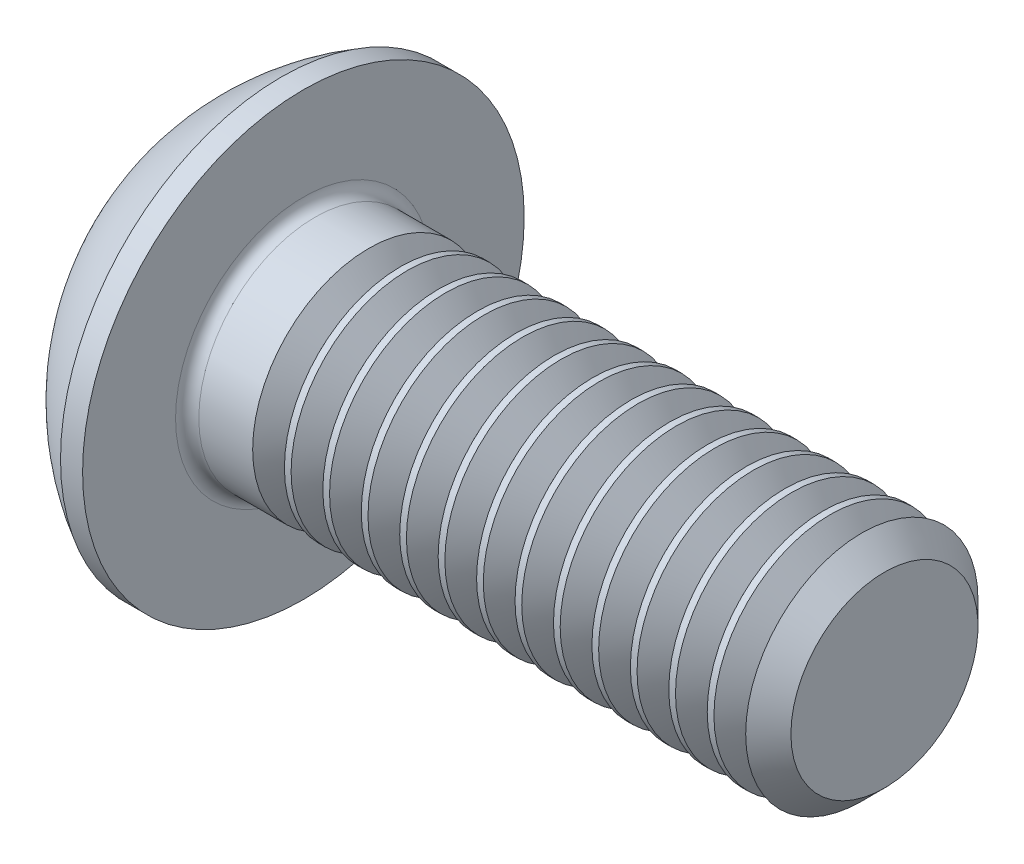
ISO-10303-21;
HEADER;
FILE_DESCRIPTION(('STEP AP214'),'2;1');
FILE_NAME('part.step','',(''),(''),'','','');
FILE_SCHEMA(('AUTOMOTIVE_DESIGN { 1 0 10303 214 1 1 1 1 }'));
ENDSEC;
DATA;
#1=APPLICATION_CONTEXT('core data for automotive mechanical design processes');
#2=APPLICATION_PROTOCOL_DEFINITION('international standard','automotive_design',2000,#1);
#3=PRODUCT_CONTEXT('',#1,'mechanical');
#4=PRODUCT('Part','Part','',(#3));
#5=PRODUCT_RELATED_PRODUCT_CATEGORY('part','',(#4));
#6=PRODUCT_DEFINITION_FORMATION('','',#4);
#7=PRODUCT_DEFINITION_CONTEXT('part definition',#1,'design');
#8=PRODUCT_DEFINITION('design','',#6,#7);
#9=PRODUCT_DEFINITION_SHAPE('','',#8);
#10=(LENGTH_UNIT() NAMED_UNIT(*) SI_UNIT(.MILLI.,.METRE.));
#11=(NAMED_UNIT(*) PLANE_ANGLE_UNIT() SI_UNIT($,.RADIAN.));
#12=(NAMED_UNIT(*) SI_UNIT($,.STERADIAN.) SOLID_ANGLE_UNIT());
#13=UNCERTAINTY_MEASURE_WITH_UNIT(LENGTH_MEASURE(1.E-05),#10,'distance_accuracy_value','');
#14=(GEOMETRIC_REPRESENTATION_CONTEXT(3) GLOBAL_UNCERTAINTY_ASSIGNED_CONTEXT((#13)) GLOBAL_UNIT_ASSIGNED_CONTEXT((#10,
#11,#12)) REPRESENTATION_CONTEXT('',''));
#15=CARTESIAN_POINT('',(0.,0.,0.));
#16=DIRECTION('',(0.,0.,1.));
#17=DIRECTION('',(1.,0.,0.));
#18=AXIS2_PLACEMENT_3D('',#15,#16,#17);
#19=CARTESIAN_POINT('',(0.,0.,0.));
#20=DIRECTION('',(-1.,0.,0.));
#21=DIRECTION('',(0.,0.,1.));
#22=AXIS2_PLACEMENT_3D('',#19,#20,#21);
#23=PLANE('',#22);
#24=CARTESIAN_POINT('',(0.,0.,0.));
#25=DIRECTION('',(-1.,0.,0.));
#26=DIRECTION('',(0.,0.,1.));
#27=AXIS2_PLACEMENT_3D('',#24,#25,#26);
#28=CIRCLE('',#27,1.9);
#29=CARTESIAN_POINT('',(0.,0.,1.9));
#30=VERTEX_POINT('',#29);
#31=EDGE_CURVE('E155',#30,#30,#28,.T.);
#32=ORIENTED_EDGE('',*,*,#31,.T.);
#33=EDGE_LOOP('',(#32));
#34=FACE_BOUND('',#33,.T.);
#35=DIRECTION('',(0.,-1.,0.));
#36=VECTOR('',#35,1.);
#37=CARTESIAN_POINT('',(0.,-0.721687836487032,1.25));
#38=LINE('',#37,#36);
#39=CARTESIAN_POINT('',(0.,0.721687836487033,1.25));
#40=VERTEX_POINT('',#39);
#41=CARTESIAN_POINT('',(0.,-0.721687836487032,1.25));
#42=VERTEX_POINT('',#41);
#43=EDGE_CURVE('E48',#40,#42,#38,.T.);
#44=ORIENTED_EDGE('',*,*,#43,.T.);
#45=DIRECTION('',(0.,-0.5,-0.866025403784439));
#46=VECTOR('',#45,1.);
#47=CARTESIAN_POINT('',(0.,-1.44337567297406,0.));
#48=LINE('',#47,#46);
#49=CARTESIAN_POINT('',(0.,-1.44337567297406,0.));
#50=VERTEX_POINT('',#49);
#51=EDGE_CURVE('E458',#42,#50,#48,.T.);
#52=ORIENTED_EDGE('',*,*,#51,.T.);
#53=DIRECTION('',(0.,0.5,-0.866025403784439));
#54=VECTOR('',#53,1.);
#55=CARTESIAN_POINT('',(0.,-0.721687836487032,-1.25));
#56=LINE('',#55,#54);
#57=CARTESIAN_POINT('',(0.,-0.721687836487032,-1.25));
#58=VERTEX_POINT('',#57);
#59=EDGE_CURVE('E133',#50,#58,#56,.T.);
#60=ORIENTED_EDGE('',*,*,#59,.T.);
#61=DIRECTION('',(0.,1.,0.));
#62=VECTOR('',#61,1.);
#63=CARTESIAN_POINT('',(0.,0.721687836487033,-1.25));
#64=LINE('',#63,#62);
#65=CARTESIAN_POINT('',(0.,0.721687836487033,-1.25));
#66=VERTEX_POINT('',#65);
#67=EDGE_CURVE('E476',#58,#66,#64,.T.);
#68=ORIENTED_EDGE('',*,*,#67,.T.);
#69=DIRECTION('',(0.,0.5,0.866025403784438));
#70=VECTOR('',#69,1.);
#71=CARTESIAN_POINT('',(0.,1.44337567297407,0.));
#72=LINE('',#71,#70);
#73=CARTESIAN_POINT('',(0.,1.44337567297407,0.));
#74=VERTEX_POINT('',#73);
#75=EDGE_CURVE('E478',#66,#74,#72,.T.);
#76=ORIENTED_EDGE('',*,*,#75,.T.);
#77=DIRECTION('',(0.,-0.5,0.866025403784438));
#78=VECTOR('',#77,1.);
#79=CARTESIAN_POINT('',(0.,0.721687836487033,1.25));
#80=LINE('',#79,#78);
#81=EDGE_CURVE('E480',#74,#40,#80,.T.);
#82=ORIENTED_EDGE('',*,*,#81,.T.);
#83=EDGE_LOOP('',(#44,#52,#60,#68,#76,#82));
#84=FACE_BOUND('',#83,.T.);
#85=ADVANCED_FACE('F32',(#34,#84),#23,.T.);
#86=CARTESIAN_POINT('',(3.88527472527472,0.,0.));
#87=DIRECTION('',(-1.,0.,0.));
#88=DIRECTION('',(0.,1.,0.));
#89=AXIS2_PLACEMENT_3D('',#86,#87,#88);
#90=SPHERICAL_SURFACE('',#89,4.3249693283142);
#91=CARTESIAN_POINT('',(1.82,0.,0.));
#92=DIRECTION('',(-1.,0.,0.));
#93=DIRECTION('',(0.,0.,1.));
#94=AXIS2_PLACEMENT_3D('',#91,#92,#93);
#95=CIRCLE('',#94,3.8);
#96=CARTESIAN_POINT('',(1.82,0.,3.8));
#97=VERTEX_POINT('',#96);
#98=EDGE_CURVE('E152',#97,#97,#95,.T.);
#99=ORIENTED_EDGE('',*,*,#98,.T.);
#100=EDGE_LOOP('',(#99));
#101=FACE_BOUND('',#100,.T.);
#102=ORIENTED_EDGE('',*,*,#31,.F.);
#103=EDGE_LOOP('',(#102));
#104=FACE_BOUND('',#103,.T.);
#105=ADVANCED_FACE('F178',(#101,#104),#90,.T.);
#106=CARTESIAN_POINT('',(0.,0.,0.));
#107=DIRECTION('',(-1.,0.,0.));
#108=DIRECTION('',(0.,0.,1.));
#109=AXIS2_PLACEMENT_3D('',#106,#107,#108);
#110=CYLINDRICAL_SURFACE('',#109,3.8);
#111=ORIENTED_EDGE('',*,*,#98,.F.);
#112=EDGE_LOOP('',(#111));
#113=FACE_BOUND('',#112,.T.);
#114=CARTESIAN_POINT('',(2.2,0.,0.));
#115=DIRECTION('',(-1.,0.,0.));
#116=DIRECTION('',(0.,0.,1.));
#117=AXIS2_PLACEMENT_3D('',#114,#115,#116);
#118=CIRCLE('',#117,3.8);
#119=CARTESIAN_POINT('',(2.2,0.,3.8));
#120=VERTEX_POINT('',#119);
#121=EDGE_CURVE('E149',#120,#120,#118,.T.);
#122=ORIENTED_EDGE('',*,*,#121,.T.);
#123=EDGE_LOOP('',(#122));
#124=FACE_BOUND('',#123,.T.);
#125=ADVANCED_FACE('F183',(#113,#124),#110,.T.);
#126=CARTESIAN_POINT('',(2.2,2.,0.));
#127=DIRECTION('',(-1.,0.,0.));
#128=DIRECTION('',(0.,0.,1.));
#129=AXIS2_PLACEMENT_3D('',#126,#127,#128);
#130=PLANE('',#129);
#131=CARTESIAN_POINT('',(2.2,0.,0.));
#132=DIRECTION('',(-1.,0.,0.));
#133=DIRECTION('',(0.,0.,1.));
#134=AXIS2_PLACEMENT_3D('',#131,#132,#133);
#135=CIRCLE('',#134,2.2);
#136=CARTESIAN_POINT('',(2.2,0.,2.2));
#137=VERTEX_POINT('',#136);
#138=EDGE_CURVE('E41',#137,#137,#135,.T.);
#139=ORIENTED_EDGE('',*,*,#138,.T.);
#140=EDGE_LOOP('',(#139));
#141=FACE_BOUND('',#140,.T.);
#142=ORIENTED_EDGE('',*,*,#121,.F.);
#143=EDGE_LOOP('',(#142));
#144=FACE_BOUND('',#143,.T.);
#145=ADVANCED_FACE('F161',(#141,#144),#130,.F.);
#146=CARTESIAN_POINT('',(0.,0.,0.));
#147=DIRECTION('',(-1.,0.,0.));
#148=DIRECTION('',(0.,0.,1.));
#149=AXIS2_PLACEMENT_3D('',#146,#147,#148);
#150=CYLINDRICAL_SURFACE('',#149,2.);
#151=CARTESIAN_POINT('',(3.32691906009821,0.,0.));
#152=DIRECTION('',(-1.,0.,0.));
#153=DIRECTION('',(0.,-1.,0.));
#154=AXIS2_PLACEMENT_3D('',#151,#152,#153);
#155=CIRCLE('',#154,2.);
#156=CARTESIAN_POINT('',(3.32691906009821,-2.,0.));
#157=VERTEX_POINT('',#156);
#158=EDGE_CURVE('E453',#157,#157,#155,.T.);
#159=ORIENTED_EDGE('',*,*,#158,.T.);
#160=EDGE_LOOP('',(#159));
#161=FACE_BOUND('',#160,.T.);
#162=CARTESIAN_POINT('',(2.4,0.,0.));
#163=DIRECTION('',(-1.,0.,0.));
#164=DIRECTION('',(0.,0.,1.));
#165=AXIS2_PLACEMENT_3D('',#162,#163,#164);
#166=CIRCLE('',#165,2.);
#167=CARTESIAN_POINT('',(2.4,0.,2.));
#168=VERTEX_POINT('',#167);
#169=EDGE_CURVE('E11',#168,#168,#166,.F.);
#170=ORIENTED_EDGE('',*,*,#169,.T.);
#171=EDGE_LOOP('',(#170));
#172=FACE_BOUND('',#171,.T.);
#173=ADVANCED_FACE('F165',(#161,#172),#150,.T.);
#174=CARTESIAN_POINT('',(2.4,0.,0.));
#175=DIRECTION('',(-1.,0.,0.));
#176=DIRECTION('',(0.,0.,1.));
#177=AXIS2_PLACEMENT_3D('',#174,#175,#176);
#178=TOROIDAL_SURFACE('',#177,2.2,0.2);
#179=ORIENTED_EDGE('',*,*,#169,.F.);
#180=EDGE_LOOP('',(#179));
#181=FACE_BOUND('',#180,.T.);
#182=ORIENTED_EDGE('',*,*,#138,.F.);
#183=EDGE_LOOP('',(#182));
#184=FACE_BOUND('',#183,.T.);
#185=ADVANCED_FACE('F34',(#181,#184),#178,.F.);
#186=CARTESIAN_POINT('',(1.3,-1.44337567297406,0.));
#187=DIRECTION('',(0.,0.866025403784439,-0.5));
#188=DIRECTION('',(0.,0.5,0.866025403784439));
#189=AXIS2_PLACEMENT_3D('',#186,#187,#188);
#190=PLANE('',#189);
#191=DIRECTION('',(0.,-0.5,-0.866025403784439));
#192=VECTOR('',#191,1.);
#193=CARTESIAN_POINT('',(1.3,-1.44337567297406,0.));
#194=LINE('',#193,#192);
#195=CARTESIAN_POINT('',(1.3,-0.721687836487032,1.25));
#196=VERTEX_POINT('',#195);
#197=CARTESIAN_POINT('',(1.3,-1.08253175473055,0.625));
#198=VERTEX_POINT('',#197);
#199=EDGE_CURVE('E116',#196,#198,#194,.T.);
#200=ORIENTED_EDGE('',*,*,#199,.T.);
#201=CARTESIAN_POINT('',(1.3,-1.44337567297406,0.));
#202=VERTEX_POINT('',#201);
#203=EDGE_CURVE('E109',#198,#202,#194,.T.);
#204=ORIENTED_EDGE('',*,*,#203,.T.);
#205=DIRECTION('',(-1.,0.,0.));
#206=VECTOR('',#205,1.);
#207=CARTESIAN_POINT('',(1.3,-1.44337567297406,0.));
#208=LINE('',#207,#206);
#209=EDGE_CURVE('E113',#202,#50,#208,.T.);
#210=ORIENTED_EDGE('',*,*,#209,.T.);
#211=ORIENTED_EDGE('',*,*,#51,.F.);
#212=DIRECTION('',(-1.,0.,0.));
#213=VECTOR('',#212,1.);
#214=CARTESIAN_POINT('',(1.3,-0.721687836487032,1.25));
#215=LINE('',#214,#213);
#216=EDGE_CURVE('E473',#196,#42,#215,.T.);
#217=ORIENTED_EDGE('',*,*,#216,.F.);
#218=EDGE_LOOP('',(#200,#204,#210,#211,#217));
#219=FACE_BOUND('',#218,.T.);
#220=ADVANCED_FACE('F111',(#219),#190,.T.);
#221=CARTESIAN_POINT('',(1.3,-0.721687836487032,-1.25));
#222=DIRECTION('',(0.,0.866025403784439,0.5));
#223=DIRECTION('',(0.,-0.5,0.866025403784439));
#224=AXIS2_PLACEMENT_3D('',#221,#222,#223);
#225=PLANE('',#224);
#226=DIRECTION('',(0.,0.5,-0.866025403784439));
#227=VECTOR('',#226,1.);
#228=CARTESIAN_POINT('',(1.3,-0.721687836487032,-1.25));
#229=LINE('',#228,#227);
#230=CARTESIAN_POINT('',(1.3,-1.08253175473055,-0.625));
#231=VERTEX_POINT('',#230);
#232=EDGE_CURVE('E121',#202,#231,#229,.T.);
#233=ORIENTED_EDGE('',*,*,#232,.T.);
#234=CARTESIAN_POINT('',(1.3,-0.721687836487032,-1.25));
#235=VERTEX_POINT('',#234);
#236=EDGE_CURVE('E128',#231,#235,#229,.T.);
#237=ORIENTED_EDGE('',*,*,#236,.T.);
#238=DIRECTION('',(-1.,0.,0.));
#239=VECTOR('',#238,1.);
#240=CARTESIAN_POINT('',(1.3,-0.721687836487032,-1.25));
#241=LINE('',#240,#239);
#242=EDGE_CURVE('E135',#235,#58,#241,.T.);
#243=ORIENTED_EDGE('',*,*,#242,.T.);
#244=ORIENTED_EDGE('',*,*,#59,.F.);
#245=ORIENTED_EDGE('',*,*,#209,.F.);
#246=EDGE_LOOP('',(#233,#237,#243,#244,#245));
#247=FACE_BOUND('',#246,.T.);
#248=ADVANCED_FACE('F131',(#247),#225,.T.);
#249=CARTESIAN_POINT('',(1.3,0.721687836487033,-1.25));
#250=DIRECTION('',(0.,0.,1.));
#251=DIRECTION('',(1.,0.,0.));
#252=AXIS2_PLACEMENT_3D('',#249,#250,#251);
#253=PLANE('',#252);
#254=DIRECTION('',(0.,1.,0.));
#255=VECTOR('',#254,1.);
#256=CARTESIAN_POINT('',(1.3,0.721687836487033,-1.25));
#257=LINE('',#256,#255);
#258=CARTESIAN_POINT('',(1.3,0.,-1.25));
#259=VERTEX_POINT('',#258);
#260=EDGE_CURVE('E460',#235,#259,#257,.T.);
#261=ORIENTED_EDGE('',*,*,#260,.T.);
#262=CARTESIAN_POINT('',(1.3,0.721687836487033,-1.25));
#263=VERTEX_POINT('',#262);
#264=EDGE_CURVE('E127',#259,#263,#257,.T.);
#265=ORIENTED_EDGE('',*,*,#264,.T.);
#266=DIRECTION('',(-1.,0.,0.));
#267=VECTOR('',#266,1.);
#268=CARTESIAN_POINT('',(1.3,0.721687836487033,-1.25));
#269=LINE('',#268,#267);
#270=EDGE_CURVE('E140',#263,#66,#269,.T.);
#271=ORIENTED_EDGE('',*,*,#270,.T.);
#272=ORIENTED_EDGE('',*,*,#67,.F.);
#273=ORIENTED_EDGE('',*,*,#242,.F.);
#274=EDGE_LOOP('',(#261,#265,#271,#272,#273));
#275=FACE_BOUND('',#274,.T.);
#276=ADVANCED_FACE('F209',(#275),#253,.T.);
#277=CARTESIAN_POINT('',(1.3,1.44337567297407,0.));
#278=DIRECTION('',(0.,-0.866025403784438,0.5));
#279=DIRECTION('',(0.,-0.5,-0.866025403784438));
#280=AXIS2_PLACEMENT_3D('',#277,#278,#279);
#281=PLANE('',#280);
#282=DIRECTION('',(0.,0.5,0.866025403784438));
#283=VECTOR('',#282,1.);
#284=CARTESIAN_POINT('',(1.3,1.44337567297407,0.));
#285=LINE('',#284,#283);
#286=CARTESIAN_POINT('',(1.3,1.08253175473055,-0.625000000000001));
#287=VERTEX_POINT('',#286);
#288=EDGE_CURVE('E464',#263,#287,#285,.T.);
#289=ORIENTED_EDGE('',*,*,#288,.T.);
#290=CARTESIAN_POINT('',(1.3,1.44337567297407,0.));
#291=VERTEX_POINT('',#290);
#292=EDGE_CURVE('E463',#287,#291,#285,.T.);
#293=ORIENTED_EDGE('',*,*,#292,.T.);
#294=DIRECTION('',(-1.,0.,0.));
#295=VECTOR('',#294,1.);
#296=CARTESIAN_POINT('',(1.3,1.44337567297407,0.));
#297=LINE('',#296,#295);
#298=EDGE_CURVE('E488',#291,#74,#297,.T.);
#299=ORIENTED_EDGE('',*,*,#298,.T.);
#300=ORIENTED_EDGE('',*,*,#75,.F.);
#301=ORIENTED_EDGE('',*,*,#270,.F.);
#302=EDGE_LOOP('',(#289,#293,#299,#300,#301));
#303=FACE_BOUND('',#302,.T.);
#304=ADVANCED_FACE('F212',(#303),#281,.T.);
#305=CARTESIAN_POINT('',(1.3,0.721687836487033,1.25));
#306=DIRECTION('',(0.,-0.866025403784438,-0.5));
#307=DIRECTION('',(0.,0.5,-0.866025403784438));
#308=AXIS2_PLACEMENT_3D('',#305,#306,#307);
#309=PLANE('',#308);
#310=DIRECTION('',(0.,-0.5,0.866025403784438));
#311=VECTOR('',#310,1.);
#312=CARTESIAN_POINT('',(1.3,0.721687836487033,1.25));
#313=LINE('',#312,#311);
#314=CARTESIAN_POINT('',(1.3,1.08253175473055,0.625000000000001));
#315=VERTEX_POINT('',#314);
#316=EDGE_CURVE('E468',#291,#315,#313,.T.);
#317=ORIENTED_EDGE('',*,*,#316,.T.);
#318=CARTESIAN_POINT('',(1.3,0.721687836487033,1.25));
#319=VERTEX_POINT('',#318);
#320=EDGE_CURVE('E467',#315,#319,#313,.T.);
#321=ORIENTED_EDGE('',*,*,#320,.T.);
#322=DIRECTION('',(-1.,0.,0.));
#323=VECTOR('',#322,1.);
#324=CARTESIAN_POINT('',(1.3,0.721687836487033,1.25));
#325=LINE('',#324,#323);
#326=EDGE_CURVE('E485',#319,#40,#325,.T.);
#327=ORIENTED_EDGE('',*,*,#326,.T.);
#328=ORIENTED_EDGE('',*,*,#81,.F.);
#329=ORIENTED_EDGE('',*,*,#298,.F.);
#330=EDGE_LOOP('',(#317,#321,#327,#328,#329));
#331=FACE_BOUND('',#330,.T.);
#332=ADVANCED_FACE('F216',(#331),#309,.T.);
#333=CARTESIAN_POINT('',(1.3,-0.721687836487032,1.25));
#334=DIRECTION('',(0.,0.,-1.));
#335=DIRECTION('',(-1.,0.,0.));
#336=AXIS2_PLACEMENT_3D('',#333,#334,#335);
#337=PLANE('',#336);
#338=DIRECTION('',(0.,-1.,0.));
#339=VECTOR('',#338,1.);
#340=CARTESIAN_POINT('',(1.3,-0.721687836487032,1.25));
#341=LINE('',#340,#339);
#342=CARTESIAN_POINT('',(1.3,0.,1.25));
#343=VERTEX_POINT('',#342);
#344=EDGE_CURVE('E56',#319,#343,#341,.T.);
#345=ORIENTED_EDGE('',*,*,#344,.T.);
#346=EDGE_CURVE('E471',#343,#196,#341,.T.);
#347=ORIENTED_EDGE('',*,*,#346,.T.);
#348=ORIENTED_EDGE('',*,*,#216,.T.);
#349=ORIENTED_EDGE('',*,*,#43,.F.);
#350=ORIENTED_EDGE('',*,*,#326,.F.);
#351=EDGE_LOOP('',(#345,#347,#348,#349,#350));
#352=FACE_BOUND('',#351,.T.);
#353=ADVANCED_FACE('F220',(#352),#337,.T.);
#354=CARTESIAN_POINT('',(1.3,0.,2.5));
#355=DIRECTION('',(-1.,0.,0.));
#356=DIRECTION('',(0.,0.,1.));
#357=AXIS2_PLACEMENT_3D('',#354,#355,#356);
#358=PLANE('',#357);
#359=ORIENTED_EDGE('',*,*,#344,.F.);
#360=ORIENTED_EDGE('',*,*,#320,.F.);
#361=CARTESIAN_POINT('',(1.3,0.,0.));
#362=DIRECTION('',(-1.,0.,0.));
#363=DIRECTION('',(0.,0.,1.));
#364=AXIS2_PLACEMENT_3D('',#361,#362,#363);
#365=CIRCLE('',#364,1.25);
#366=EDGE_CURVE('E139',#343,#315,#365,.T.);
#367=ORIENTED_EDGE('',*,*,#366,.F.);
#368=EDGE_LOOP('',(#359,#360,#367));
#369=FACE_BOUND('',#368,.T.);
#370=ADVANCED_FACE('F224',(#369),#358,.T.);
#371=ORIENTED_EDGE('',*,*,#316,.F.);
#372=ORIENTED_EDGE('',*,*,#292,.F.);
#373=EDGE_CURVE('E146',#315,#287,#365,.T.);
#374=ORIENTED_EDGE('',*,*,#373,.F.);
#375=EDGE_LOOP('',(#371,#372,#374));
#376=FACE_BOUND('',#375,.T.);
#377=ADVANCED_FACE('F514',(#376),#358,.T.);
#378=ORIENTED_EDGE('',*,*,#288,.F.);
#379=ORIENTED_EDGE('',*,*,#264,.F.);
#380=EDGE_CURVE('E504',#287,#259,#365,.T.);
#381=ORIENTED_EDGE('',*,*,#380,.F.);
#382=EDGE_LOOP('',(#378,#379,#381));
#383=FACE_BOUND('',#382,.T.);
#384=ADVANCED_FACE('F506',(#383),#358,.T.);
#385=ORIENTED_EDGE('',*,*,#260,.F.);
#386=ORIENTED_EDGE('',*,*,#236,.F.);
#387=EDGE_CURVE('E503',#259,#231,#365,.T.);
#388=ORIENTED_EDGE('',*,*,#387,.F.);
#389=EDGE_LOOP('',(#385,#386,#388));
#390=FACE_BOUND('',#389,.T.);
#391=ADVANCED_FACE('F502',(#390),#358,.T.);
#392=ORIENTED_EDGE('',*,*,#232,.F.);
#393=ORIENTED_EDGE('',*,*,#203,.F.);
#394=EDGE_CURVE('E123',#231,#198,#365,.T.);
#395=ORIENTED_EDGE('',*,*,#394,.F.);
#396=EDGE_LOOP('',(#392,#393,#395));
#397=FACE_BOUND('',#396,.T.);
#398=ADVANCED_FACE('F122',(#397),#358,.T.);
#399=ORIENTED_EDGE('',*,*,#199,.F.);
#400=ORIENTED_EDGE('',*,*,#346,.F.);
#401=EDGE_CURVE('E134',#198,#343,#365,.T.);
#402=ORIENTED_EDGE('',*,*,#401,.F.);
#403=EDGE_LOOP('',(#399,#400,#402));
#404=FACE_BOUND('',#403,.T.);
#405=ADVANCED_FACE('F204',(#404),#358,.T.);
#406=CARTESIAN_POINT('',(2.02168783648704,0.,0.));
#407=DIRECTION('',(-1.,0.,0.));
#408=DIRECTION('',(0.,0.,1.));
#409=AXIS2_PLACEMENT_3D('',#406,#407,#408);
#410=CONICAL_SURFACE('',#409,0.,1.04719755119659);
#411=ORIENTED_EDGE('',*,*,#366,.T.);
#412=ORIENTED_EDGE('',*,*,#373,.T.);
#413=ORIENTED_EDGE('',*,*,#380,.T.);
#414=ORIENTED_EDGE('',*,*,#387,.T.);
#415=ORIENTED_EDGE('',*,*,#394,.T.);
#416=ORIENTED_EDGE('',*,*,#401,.T.);
#417=EDGE_LOOP('',(#411,#412,#413,#414,#415,#416));
#418=FACE_BOUND('',#417,.T.);
#419=CARTESIAN_POINT('',(2.02168783648704,0.,0.));
#420=VERTEX_POINT('',#419);
#421=VERTEX_LOOP('',#420);
#422=FACE_BOUND('',#421,.T.);
#423=ADVANCED_FACE('F201',(#418,#422),#410,.F.);
#424=CARTESIAN_POINT('',(3.87308093990179,0.,0.));
#425=DIRECTION('',(1.,0.,0.));
#426=DIRECTION('',(0.,1.,0.));
#427=AXIS2_PLACEMENT_3D('',#424,#425,#426);
#428=CONICAL_SURFACE('',#427,2.,0.959931088596882);
#429=CARTESIAN_POINT('',(3.6,0.,0.));
#430=DIRECTION('',(-1.,0.,0.));
#431=DIRECTION('',(0.,-1.,0.));
#432=AXIS2_PLACEMENT_3D('',#429,#430,#431);
#433=CIRCLE('',#432,1.61);
#434=CARTESIAN_POINT('',(3.6,-1.61,0.));
#435=VERTEX_POINT('',#434);
#436=EDGE_CURVE('E450',#435,#435,#433,.T.);
#437=ORIENTED_EDGE('',*,*,#436,.F.);
#438=EDGE_LOOP('',(#437));
#439=FACE_BOUND('',#438,.T.);
#440=CARTESIAN_POINT('',(3.87308093990179,0.,0.));
#441=DIRECTION('',(-1.,0.,0.));
#442=DIRECTION('',(0.,-1.,0.));
#443=AXIS2_PLACEMENT_3D('',#440,#441,#442);
#444=CIRCLE('',#443,2.);
#445=CARTESIAN_POINT('',(3.87308093990179,-2.,0.));
#446=VERTEX_POINT('',#445);
#447=EDGE_CURVE('E456',#446,#446,#444,.T.);
#448=ORIENTED_EDGE('',*,*,#447,.T.);
#449=EDGE_LOOP('',(#448));
#450=FACE_BOUND('',#449,.T.);
#451=ADVANCED_FACE('F203',(#439,#450),#428,.T.);
#452=CARTESIAN_POINT('',(3.6,0.,0.));
#453=DIRECTION('',(-1.,0.,0.));
#454=DIRECTION('',(0.,-1.,0.));
#455=AXIS2_PLACEMENT_3D('',#452,#453,#454);
#456=CONICAL_SURFACE('',#455,1.61,0.959931088596877);
#457=ORIENTED_EDGE('',*,*,#158,.F.);
#458=EDGE_LOOP('',(#457));
#459=FACE_BOUND('',#458,.T.);
#460=ORIENTED_EDGE('',*,*,#436,.T.);
#461=EDGE_LOOP('',(#460));
#462=FACE_BOUND('',#461,.T.);
#463=ADVANCED_FACE('F230',(#459,#462),#456,.T.);
#464=CARTESIAN_POINT('',(3.98845752163667,0.,0.));
#465=DIRECTION('',(-1.,0.,0.));
#466=DIRECTION('',(0.,-1.,0.));
#467=AXIS2_PLACEMENT_3D('',#464,#465,#466);
#468=CIRCLE('',#467,2.);
#469=CARTESIAN_POINT('',(3.98845752163667,-2.,0.));
#470=VERTEX_POINT('',#469);
#471=EDGE_CURVE('E444',#470,#470,#468,.T.);
#472=ORIENTED_EDGE('',*,*,#471,.T.);
#473=EDGE_LOOP('',(#472));
#474=FACE_BOUND('',#473,.T.);
#475=ORIENTED_EDGE('',*,*,#447,.F.);
#476=EDGE_LOOP('',(#475));
#477=FACE_BOUND('',#476,.T.);
#478=ADVANCED_FACE('F175',(#474,#477),#150,.T.);
#479=CARTESIAN_POINT('',(4.53461940144025,0.,0.));
#480=DIRECTION('',(1.,0.,0.));
#481=DIRECTION('',(0.,1.,0.));
#482=AXIS2_PLACEMENT_3D('',#479,#480,#481);
#483=CONICAL_SURFACE('',#482,2.,0.959931088596882);
#484=CARTESIAN_POINT('',(4.26153846153846,0.,0.));
#485=DIRECTION('',(-1.,0.,0.));
#486=DIRECTION('',(0.,-1.,0.));
#487=AXIS2_PLACEMENT_3D('',#484,#485,#486);
#488=CIRCLE('',#487,1.61);
#489=CARTESIAN_POINT('',(4.26153846153846,-1.61,0.));
#490=VERTEX_POINT('',#489);
#491=EDGE_CURVE('E441',#490,#490,#488,.T.);
#492=ORIENTED_EDGE('',*,*,#491,.F.);
#493=EDGE_LOOP('',(#492));
#494=FACE_BOUND('',#493,.T.);
#495=CARTESIAN_POINT('',(4.53461940144025,0.,0.));
#496=DIRECTION('',(-1.,0.,0.));
#497=DIRECTION('',(0.,-1.,0.));
#498=AXIS2_PLACEMENT_3D('',#495,#496,#497);
#499=CIRCLE('',#498,2.);
#500=CARTESIAN_POINT('',(4.53461940144025,-2.,0.));
#501=VERTEX_POINT('',#500);
#502=EDGE_CURVE('E447',#501,#501,#499,.T.);
#503=ORIENTED_EDGE('',*,*,#502,.T.);
#504=EDGE_LOOP('',(#503));
#505=FACE_BOUND('',#504,.T.);
#506=ADVANCED_FACE('F235',(#494,#505),#483,.T.);
#507=CARTESIAN_POINT('',(4.26153846153846,0.,0.));
#508=DIRECTION('',(-1.,0.,0.));
#509=DIRECTION('',(0.,-1.,0.));
#510=AXIS2_PLACEMENT_3D('',#507,#508,#509);
#511=CONICAL_SURFACE('',#510,1.61,0.959931088596877);
#512=ORIENTED_EDGE('',*,*,#471,.F.);
#513=EDGE_LOOP('',(#512));
#514=FACE_BOUND('',#513,.T.);
#515=ORIENTED_EDGE('',*,*,#491,.T.);
#516=EDGE_LOOP('',(#515));
#517=FACE_BOUND('',#516,.T.);
#518=ADVANCED_FACE('F238',(#514,#517),#511,.T.);
#519=CARTESIAN_POINT('',(4.64999598317513,0.,0.));
#520=DIRECTION('',(-1.,0.,0.));
#521=DIRECTION('',(0.,-1.,0.));
#522=AXIS2_PLACEMENT_3D('',#519,#520,#521);
#523=CIRCLE('',#522,2.);
#524=CARTESIAN_POINT('',(4.64999598317513,-2.,0.));
#525=VERTEX_POINT('',#524);
#526=EDGE_CURVE('E435',#525,#525,#523,.T.);
#527=ORIENTED_EDGE('',*,*,#526,.T.);
#528=EDGE_LOOP('',(#527));
#529=FACE_BOUND('',#528,.T.);
#530=ORIENTED_EDGE('',*,*,#502,.F.);
#531=EDGE_LOOP('',(#530));
#532=FACE_BOUND('',#531,.T.);
#533=ADVANCED_FACE('F242',(#529,#532),#150,.T.);
#534=CARTESIAN_POINT('',(5.19615786297871,0.,0.));
#535=DIRECTION('',(1.,0.,0.));
#536=DIRECTION('',(0.,1.,0.));
#537=AXIS2_PLACEMENT_3D('',#534,#535,#536);
#538=CONICAL_SURFACE('',#537,2.,0.959931088596882);
#539=CARTESIAN_POINT('',(4.92307692307692,0.,0.));
#540=DIRECTION('',(-1.,0.,0.));
#541=DIRECTION('',(0.,-1.,0.));
#542=AXIS2_PLACEMENT_3D('',#539,#540,#541);
#543=CIRCLE('',#542,1.61);
#544=CARTESIAN_POINT('',(4.92307692307692,-1.61,0.));
#545=VERTEX_POINT('',#544);
#546=EDGE_CURVE('E432',#545,#545,#543,.T.);
#547=ORIENTED_EDGE('',*,*,#546,.F.);
#548=EDGE_LOOP('',(#547));
#549=FACE_BOUND('',#548,.T.);
#550=CARTESIAN_POINT('',(5.19615786297871,0.,0.));
#551=DIRECTION('',(-1.,0.,0.));
#552=DIRECTION('',(0.,-1.,0.));
#553=AXIS2_PLACEMENT_3D('',#550,#551,#552);
#554=CIRCLE('',#553,2.);
#555=CARTESIAN_POINT('',(5.19615786297871,-2.,0.));
#556=VERTEX_POINT('',#555);
#557=EDGE_CURVE('E438',#556,#556,#554,.T.);
#558=ORIENTED_EDGE('',*,*,#557,.T.);
#559=EDGE_LOOP('',(#558));
#560=FACE_BOUND('',#559,.T.);
#561=ADVANCED_FACE('F244',(#549,#560),#538,.T.);
#562=CARTESIAN_POINT('',(4.92307692307692,0.,0.));
#563=DIRECTION('',(-1.,0.,0.));
#564=DIRECTION('',(0.,-1.,0.));
#565=AXIS2_PLACEMENT_3D('',#562,#563,#564);
#566=CONICAL_SURFACE('',#565,1.61,0.959931088596877);
#567=ORIENTED_EDGE('',*,*,#526,.F.);
#568=EDGE_LOOP('',(#567));
#569=FACE_BOUND('',#568,.T.);
#570=ORIENTED_EDGE('',*,*,#546,.T.);
#571=EDGE_LOOP('',(#570));
#572=FACE_BOUND('',#571,.T.);
#573=ADVANCED_FACE('F247',(#569,#572),#566,.T.);
#574=CARTESIAN_POINT('',(5.31153444471359,0.,0.));
#575=DIRECTION('',(-1.,0.,0.));
#576=DIRECTION('',(0.,-1.,0.));
#577=AXIS2_PLACEMENT_3D('',#574,#575,#576);
#578=CIRCLE('',#577,2.);
#579=CARTESIAN_POINT('',(5.31153444471359,-2.,0.));
#580=VERTEX_POINT('',#579);
#581=EDGE_CURVE('E426',#580,#580,#578,.T.);
#582=ORIENTED_EDGE('',*,*,#581,.T.);
#583=EDGE_LOOP('',(#582));
#584=FACE_BOUND('',#583,.T.);
#585=ORIENTED_EDGE('',*,*,#557,.F.);
#586=EDGE_LOOP('',(#585));
#587=FACE_BOUND('',#586,.T.);
#588=ADVANCED_FACE('F251',(#584,#587),#150,.T.);
#589=CARTESIAN_POINT('',(5.85769632451717,0.,0.));
#590=DIRECTION('',(1.,0.,0.));
#591=DIRECTION('',(0.,1.,0.));
#592=AXIS2_PLACEMENT_3D('',#589,#590,#591);
#593=CONICAL_SURFACE('',#592,2.,0.959931088596882);
#594=CARTESIAN_POINT('',(5.58461538461538,0.,0.));
#595=DIRECTION('',(-1.,0.,0.));
#596=DIRECTION('',(0.,-1.,0.));
#597=AXIS2_PLACEMENT_3D('',#594,#595,#596);
#598=CIRCLE('',#597,1.61);
#599=CARTESIAN_POINT('',(5.58461538461538,-1.61,0.));
#600=VERTEX_POINT('',#599);
#601=EDGE_CURVE('E423',#600,#600,#598,.T.);
#602=ORIENTED_EDGE('',*,*,#601,.F.);
#603=EDGE_LOOP('',(#602));
#604=FACE_BOUND('',#603,.T.);
#605=CARTESIAN_POINT('',(5.85769632451717,0.,0.));
#606=DIRECTION('',(-1.,0.,0.));
#607=DIRECTION('',(0.,-1.,0.));
#608=AXIS2_PLACEMENT_3D('',#605,#606,#607);
#609=CIRCLE('',#608,2.);
#610=CARTESIAN_POINT('',(5.85769632451717,-2.,0.));
#611=VERTEX_POINT('',#610);
#612=EDGE_CURVE('E429',#611,#611,#609,.T.);
#613=ORIENTED_EDGE('',*,*,#612,.T.);
#614=EDGE_LOOP('',(#613));
#615=FACE_BOUND('',#614,.T.);
#616=ADVANCED_FACE('F253',(#604,#615),#593,.T.);
#617=CARTESIAN_POINT('',(5.58461538461538,0.,0.));
#618=DIRECTION('',(-1.,0.,0.));
#619=DIRECTION('',(0.,-1.,0.));
#620=AXIS2_PLACEMENT_3D('',#617,#618,#619);
#621=CONICAL_SURFACE('',#620,1.61,0.959931088596877);
#622=ORIENTED_EDGE('',*,*,#581,.F.);
#623=EDGE_LOOP('',(#622));
#624=FACE_BOUND('',#623,.T.);
#625=ORIENTED_EDGE('',*,*,#601,.T.);
#626=EDGE_LOOP('',(#625));
#627=FACE_BOUND('',#626,.T.);
#628=ADVANCED_FACE('F256',(#624,#627),#621,.T.);
#629=CARTESIAN_POINT('',(5.97307290625206,0.,0.));
#630=DIRECTION('',(-1.,0.,0.));
#631=DIRECTION('',(0.,-1.,0.));
#632=AXIS2_PLACEMENT_3D('',#629,#630,#631);
#633=CIRCLE('',#632,2.);
#634=CARTESIAN_POINT('',(5.97307290625206,-2.,0.));
#635=VERTEX_POINT('',#634);
#636=EDGE_CURVE('E417',#635,#635,#633,.T.);
#637=ORIENTED_EDGE('',*,*,#636,.T.);
#638=EDGE_LOOP('',(#637));
#639=FACE_BOUND('',#638,.T.);
#640=ORIENTED_EDGE('',*,*,#612,.F.);
#641=EDGE_LOOP('',(#640));
#642=FACE_BOUND('',#641,.T.);
#643=ADVANCED_FACE('F260',(#639,#642),#150,.T.);
#644=CARTESIAN_POINT('',(6.51923478605563,0.,0.));
#645=DIRECTION('',(1.,0.,0.));
#646=DIRECTION('',(0.,1.,0.));
#647=AXIS2_PLACEMENT_3D('',#644,#645,#646);
#648=CONICAL_SURFACE('',#647,2.,0.959931088596882);
#649=CARTESIAN_POINT('',(6.24615384615385,0.,0.));
#650=DIRECTION('',(-1.,0.,0.));
#651=DIRECTION('',(0.,-1.,0.));
#652=AXIS2_PLACEMENT_3D('',#649,#650,#651);
#653=CIRCLE('',#652,1.61);
#654=CARTESIAN_POINT('',(6.24615384615385,-1.61,0.));
#655=VERTEX_POINT('',#654);
#656=EDGE_CURVE('E414',#655,#655,#653,.T.);
#657=ORIENTED_EDGE('',*,*,#656,.F.);
#658=EDGE_LOOP('',(#657));
#659=FACE_BOUND('',#658,.T.);
#660=CARTESIAN_POINT('',(6.51923478605563,0.,0.));
#661=DIRECTION('',(-1.,0.,0.));
#662=DIRECTION('',(0.,-1.,0.));
#663=AXIS2_PLACEMENT_3D('',#660,#661,#662);
#664=CIRCLE('',#663,2.);
#665=CARTESIAN_POINT('',(6.51923478605563,-2.,0.));
#666=VERTEX_POINT('',#665);
#667=EDGE_CURVE('E420',#666,#666,#664,.T.);
#668=ORIENTED_EDGE('',*,*,#667,.T.);
#669=EDGE_LOOP('',(#668));
#670=FACE_BOUND('',#669,.T.);
#671=ADVANCED_FACE('F262',(#659,#670),#648,.T.);
#672=CARTESIAN_POINT('',(6.24615384615385,0.,0.));
#673=DIRECTION('',(-1.,0.,0.));
#674=DIRECTION('',(0.,-1.,0.));
#675=AXIS2_PLACEMENT_3D('',#672,#673,#674);
#676=CONICAL_SURFACE('',#675,1.61,0.959931088596877);
#677=ORIENTED_EDGE('',*,*,#636,.F.);
#678=EDGE_LOOP('',(#677));
#679=FACE_BOUND('',#678,.T.);
#680=ORIENTED_EDGE('',*,*,#656,.T.);
#681=EDGE_LOOP('',(#680));
#682=FACE_BOUND('',#681,.T.);
#683=ADVANCED_FACE('F265',(#679,#682),#676,.T.);
#684=CARTESIAN_POINT('',(6.63461136779052,0.,0.));
#685=DIRECTION('',(-1.,0.,0.));
#686=DIRECTION('',(0.,-1.,0.));
#687=AXIS2_PLACEMENT_3D('',#684,#685,#686);
#688=CIRCLE('',#687,2.);
#689=CARTESIAN_POINT('',(6.63461136779052,-2.,0.));
#690=VERTEX_POINT('',#689);
#691=EDGE_CURVE('E408',#690,#690,#688,.T.);
#692=ORIENTED_EDGE('',*,*,#691,.T.);
#693=EDGE_LOOP('',(#692));
#694=FACE_BOUND('',#693,.T.);
#695=ORIENTED_EDGE('',*,*,#667,.F.);
#696=EDGE_LOOP('',(#695));
#697=FACE_BOUND('',#696,.T.);
#698=ADVANCED_FACE('F269',(#694,#697),#150,.T.);
#699=CARTESIAN_POINT('',(7.18077324759409,0.,0.));
#700=DIRECTION('',(1.,0.,0.));
#701=DIRECTION('',(0.,1.,0.));
#702=AXIS2_PLACEMENT_3D('',#699,#700,#701);
#703=CONICAL_SURFACE('',#702,2.,0.959931088596882);
#704=CARTESIAN_POINT('',(6.90769230769231,0.,0.));
#705=DIRECTION('',(-1.,0.,0.));
#706=DIRECTION('',(0.,-1.,0.));
#707=AXIS2_PLACEMENT_3D('',#704,#705,#706);
#708=CIRCLE('',#707,1.61);
#709=CARTESIAN_POINT('',(6.90769230769231,-1.61,0.));
#710=VERTEX_POINT('',#709);
#711=EDGE_CURVE('E405',#710,#710,#708,.T.);
#712=ORIENTED_EDGE('',*,*,#711,.F.);
#713=EDGE_LOOP('',(#712));
#714=FACE_BOUND('',#713,.T.);
#715=CARTESIAN_POINT('',(7.18077324759409,0.,0.));
#716=DIRECTION('',(-1.,0.,0.));
#717=DIRECTION('',(0.,-1.,0.));
#718=AXIS2_PLACEMENT_3D('',#715,#716,#717);
#719=CIRCLE('',#718,2.);
#720=CARTESIAN_POINT('',(7.18077324759409,-2.,0.));
#721=VERTEX_POINT('',#720);
#722=EDGE_CURVE('E411',#721,#721,#719,.T.);
#723=ORIENTED_EDGE('',*,*,#722,.T.);
#724=EDGE_LOOP('',(#723));
#725=FACE_BOUND('',#724,.T.);
#726=ADVANCED_FACE('F271',(#714,#725),#703,.T.);
#727=CARTESIAN_POINT('',(6.90769230769231,0.,0.));
#728=DIRECTION('',(-1.,0.,0.));
#729=DIRECTION('',(0.,-1.,0.));
#730=AXIS2_PLACEMENT_3D('',#727,#728,#729);
#731=CONICAL_SURFACE('',#730,1.61,0.959931088596877);
#732=ORIENTED_EDGE('',*,*,#691,.F.);
#733=EDGE_LOOP('',(#732));
#734=FACE_BOUND('',#733,.T.);
#735=ORIENTED_EDGE('',*,*,#711,.T.);
#736=EDGE_LOOP('',(#735));
#737=FACE_BOUND('',#736,.T.);
#738=ADVANCED_FACE('F274',(#734,#737),#731,.T.);
#739=CARTESIAN_POINT('',(7.29614982932898,0.,0.));
#740=DIRECTION('',(-1.,0.,0.));
#741=DIRECTION('',(0.,-1.,0.));
#742=AXIS2_PLACEMENT_3D('',#739,#740,#741);
#743=CIRCLE('',#742,2.);
#744=CARTESIAN_POINT('',(7.29614982932898,-2.,0.));
#745=VERTEX_POINT('',#744);
#746=EDGE_CURVE('E399',#745,#745,#743,.T.);
#747=ORIENTED_EDGE('',*,*,#746,.T.);
#748=EDGE_LOOP('',(#747));
#749=FACE_BOUND('',#748,.T.);
#750=ORIENTED_EDGE('',*,*,#722,.F.);
#751=EDGE_LOOP('',(#750));
#752=FACE_BOUND('',#751,.T.);
#753=ADVANCED_FACE('F278',(#749,#752),#150,.T.);
#754=CARTESIAN_POINT('',(7.84231170913255,0.,0.));
#755=DIRECTION('',(1.,0.,0.));
#756=DIRECTION('',(0.,1.,0.));
#757=AXIS2_PLACEMENT_3D('',#754,#755,#756);
#758=CONICAL_SURFACE('',#757,2.,0.959931088596882);
#759=CARTESIAN_POINT('',(7.56923076923077,0.,0.));
#760=DIRECTION('',(-1.,0.,0.));
#761=DIRECTION('',(0.,-1.,0.));
#762=AXIS2_PLACEMENT_3D('',#759,#760,#761);
#763=CIRCLE('',#762,1.61);
#764=CARTESIAN_POINT('',(7.56923076923077,-1.61,0.));
#765=VERTEX_POINT('',#764);
#766=EDGE_CURVE('E396',#765,#765,#763,.T.);
#767=ORIENTED_EDGE('',*,*,#766,.F.);
#768=EDGE_LOOP('',(#767));
#769=FACE_BOUND('',#768,.T.);
#770=CARTESIAN_POINT('',(7.84231170913255,0.,0.));
#771=DIRECTION('',(-1.,0.,0.));
#772=DIRECTION('',(0.,-1.,0.));
#773=AXIS2_PLACEMENT_3D('',#770,#771,#772);
#774=CIRCLE('',#773,2.);
#775=CARTESIAN_POINT('',(7.84231170913255,-2.,0.));
#776=VERTEX_POINT('',#775);
#777=EDGE_CURVE('E402',#776,#776,#774,.T.);
#778=ORIENTED_EDGE('',*,*,#777,.T.);
#779=EDGE_LOOP('',(#778));
#780=FACE_BOUND('',#779,.T.);
#781=ADVANCED_FACE('F280',(#769,#780),#758,.T.);
#782=CARTESIAN_POINT('',(7.56923076923077,0.,0.));
#783=DIRECTION('',(-1.,0.,0.));
#784=DIRECTION('',(0.,-1.,0.));
#785=AXIS2_PLACEMENT_3D('',#782,#783,#784);
#786=CONICAL_SURFACE('',#785,1.61,0.959931088596877);
#787=ORIENTED_EDGE('',*,*,#746,.F.);
#788=EDGE_LOOP('',(#787));
#789=FACE_BOUND('',#788,.T.);
#790=ORIENTED_EDGE('',*,*,#766,.T.);
#791=EDGE_LOOP('',(#790));
#792=FACE_BOUND('',#791,.T.);
#793=ADVANCED_FACE('F283',(#789,#792),#786,.T.);
#794=CARTESIAN_POINT('',(7.95768829086744,0.,0.));
#795=DIRECTION('',(-1.,0.,0.));
#796=DIRECTION('',(0.,-1.,0.));
#797=AXIS2_PLACEMENT_3D('',#794,#795,#796);
#798=CIRCLE('',#797,2.);
#799=CARTESIAN_POINT('',(7.95768829086744,-2.,0.));
#800=VERTEX_POINT('',#799);
#801=EDGE_CURVE('E390',#800,#800,#798,.T.);
#802=ORIENTED_EDGE('',*,*,#801,.T.);
#803=EDGE_LOOP('',(#802));
#804=FACE_BOUND('',#803,.T.);
#805=ORIENTED_EDGE('',*,*,#777,.F.);
#806=EDGE_LOOP('',(#805));
#807=FACE_BOUND('',#806,.T.);
#808=ADVANCED_FACE('F287',(#804,#807),#150,.T.);
#809=CARTESIAN_POINT('',(8.50385017067102,0.,0.));
#810=DIRECTION('',(1.,0.,0.));
#811=DIRECTION('',(0.,1.,0.));
#812=AXIS2_PLACEMENT_3D('',#809,#810,#811);
#813=CONICAL_SURFACE('',#812,2.,0.959931088596882);
#814=CARTESIAN_POINT('',(8.23076923076923,0.,0.));
#815=DIRECTION('',(-1.,0.,0.));
#816=DIRECTION('',(0.,-1.,0.));
#817=AXIS2_PLACEMENT_3D('',#814,#815,#816);
#818=CIRCLE('',#817,1.61);
#819=CARTESIAN_POINT('',(8.23076923076923,-1.61,0.));
#820=VERTEX_POINT('',#819);
#821=EDGE_CURVE('E387',#820,#820,#818,.T.);
#822=ORIENTED_EDGE('',*,*,#821,.F.);
#823=EDGE_LOOP('',(#822));
#824=FACE_BOUND('',#823,.T.);
#825=CARTESIAN_POINT('',(8.50385017067102,0.,0.));
#826=DIRECTION('',(-1.,0.,0.));
#827=DIRECTION('',(0.,-1.,0.));
#828=AXIS2_PLACEMENT_3D('',#825,#826,#827);
#829=CIRCLE('',#828,2.);
#830=CARTESIAN_POINT('',(8.50385017067102,-2.,0.));
#831=VERTEX_POINT('',#830);
#832=EDGE_CURVE('E393',#831,#831,#829,.T.);
#833=ORIENTED_EDGE('',*,*,#832,.T.);
#834=EDGE_LOOP('',(#833));
#835=FACE_BOUND('',#834,.T.);
#836=ADVANCED_FACE('F289',(#824,#835),#813,.T.);
#837=CARTESIAN_POINT('',(8.23076923076923,0.,0.));
#838=DIRECTION('',(-1.,0.,0.));
#839=DIRECTION('',(0.,-1.,0.));
#840=AXIS2_PLACEMENT_3D('',#837,#838,#839);
#841=CONICAL_SURFACE('',#840,1.61,0.959931088596877);
#842=ORIENTED_EDGE('',*,*,#801,.F.);
#843=EDGE_LOOP('',(#842));
#844=FACE_BOUND('',#843,.T.);
#845=ORIENTED_EDGE('',*,*,#821,.T.);
#846=EDGE_LOOP('',(#845));
#847=FACE_BOUND('',#846,.T.);
#848=ADVANCED_FACE('F292',(#844,#847),#841,.T.);
#849=CARTESIAN_POINT('',(8.6192267524059,0.,0.));
#850=DIRECTION('',(-1.,0.,0.));
#851=DIRECTION('',(0.,-1.,0.));
#852=AXIS2_PLACEMENT_3D('',#849,#850,#851);
#853=CIRCLE('',#852,2.);
#854=CARTESIAN_POINT('',(8.6192267524059,-2.,0.));
#855=VERTEX_POINT('',#854);
#856=EDGE_CURVE('E381',#855,#855,#853,.T.);
#857=ORIENTED_EDGE('',*,*,#856,.T.);
#858=EDGE_LOOP('',(#857));
#859=FACE_BOUND('',#858,.T.);
#860=ORIENTED_EDGE('',*,*,#832,.F.);
#861=EDGE_LOOP('',(#860));
#862=FACE_BOUND('',#861,.T.);
#863=ADVANCED_FACE('F296',(#859,#862),#150,.T.);
#864=CARTESIAN_POINT('',(9.16538863220948,0.,0.));
#865=DIRECTION('',(1.,0.,0.));
#866=DIRECTION('',(0.,1.,0.));
#867=AXIS2_PLACEMENT_3D('',#864,#865,#866);
#868=CONICAL_SURFACE('',#867,2.,0.959931088596882);
#869=CARTESIAN_POINT('',(8.89230769230769,0.,0.));
#870=DIRECTION('',(-1.,0.,0.));
#871=DIRECTION('',(0.,-1.,0.));
#872=AXIS2_PLACEMENT_3D('',#869,#870,#871);
#873=CIRCLE('',#872,1.61);
#874=CARTESIAN_POINT('',(8.89230769230769,-1.61,0.));
#875=VERTEX_POINT('',#874);
#876=EDGE_CURVE('E378',#875,#875,#873,.T.);
#877=ORIENTED_EDGE('',*,*,#876,.F.);
#878=EDGE_LOOP('',(#877));
#879=FACE_BOUND('',#878,.T.);
#880=CARTESIAN_POINT('',(9.16538863220948,0.,0.));
#881=DIRECTION('',(-1.,0.,0.));
#882=DIRECTION('',(0.,-1.,0.));
#883=AXIS2_PLACEMENT_3D('',#880,#881,#882);
#884=CIRCLE('',#883,2.);
#885=CARTESIAN_POINT('',(9.16538863220948,-2.,0.));
#886=VERTEX_POINT('',#885);
#887=EDGE_CURVE('E384',#886,#886,#884,.T.);
#888=ORIENTED_EDGE('',*,*,#887,.T.);
#889=EDGE_LOOP('',(#888));
#890=FACE_BOUND('',#889,.T.);
#891=ADVANCED_FACE('F298',(#879,#890),#868,.T.);
#892=CARTESIAN_POINT('',(8.89230769230769,0.,0.));
#893=DIRECTION('',(-1.,0.,0.));
#894=DIRECTION('',(0.,-1.,0.));
#895=AXIS2_PLACEMENT_3D('',#892,#893,#894);
#896=CONICAL_SURFACE('',#895,1.61,0.959931088596877);
#897=ORIENTED_EDGE('',*,*,#856,.F.);
#898=EDGE_LOOP('',(#897));
#899=FACE_BOUND('',#898,.T.);
#900=ORIENTED_EDGE('',*,*,#876,.T.);
#901=EDGE_LOOP('',(#900));
#902=FACE_BOUND('',#901,.T.);
#903=ADVANCED_FACE('F301',(#899,#902),#896,.T.);
#904=CARTESIAN_POINT('',(9.28076521394436,0.,0.));
#905=DIRECTION('',(-1.,0.,0.));
#906=DIRECTION('',(0.,-1.,0.));
#907=AXIS2_PLACEMENT_3D('',#904,#905,#906);
#908=CIRCLE('',#907,2.);
#909=CARTESIAN_POINT('',(9.28076521394436,-2.,0.));
#910=VERTEX_POINT('',#909);
#911=EDGE_CURVE('E372',#910,#910,#908,.T.);
#912=ORIENTED_EDGE('',*,*,#911,.T.);
#913=EDGE_LOOP('',(#912));
#914=FACE_BOUND('',#913,.T.);
#915=ORIENTED_EDGE('',*,*,#887,.F.);
#916=EDGE_LOOP('',(#915));
#917=FACE_BOUND('',#916,.T.);
#918=ADVANCED_FACE('F305',(#914,#917),#150,.T.);
#919=CARTESIAN_POINT('',(9.82692709374794,0.,0.));
#920=DIRECTION('',(1.,0.,0.));
#921=DIRECTION('',(0.,1.,0.));
#922=AXIS2_PLACEMENT_3D('',#919,#920,#921);
#923=CONICAL_SURFACE('',#922,2.,0.959931088596882);
#924=CARTESIAN_POINT('',(9.55384615384615,0.,0.));
#925=DIRECTION('',(-1.,0.,0.));
#926=DIRECTION('',(0.,-1.,0.));
#927=AXIS2_PLACEMENT_3D('',#924,#925,#926);
#928=CIRCLE('',#927,1.61);
#929=CARTESIAN_POINT('',(9.55384615384615,-1.61,0.));
#930=VERTEX_POINT('',#929);
#931=EDGE_CURVE('E369',#930,#930,#928,.T.);
#932=ORIENTED_EDGE('',*,*,#931,.F.);
#933=EDGE_LOOP('',(#932));
#934=FACE_BOUND('',#933,.T.);
#935=CARTESIAN_POINT('',(9.82692709374794,0.,0.));
#936=DIRECTION('',(-1.,0.,0.));
#937=DIRECTION('',(0.,-1.,0.));
#938=AXIS2_PLACEMENT_3D('',#935,#936,#937);
#939=CIRCLE('',#938,2.);
#940=CARTESIAN_POINT('',(9.82692709374794,-2.,0.));
#941=VERTEX_POINT('',#940);
#942=EDGE_CURVE('E375',#941,#941,#939,.T.);
#943=ORIENTED_EDGE('',*,*,#942,.T.);
#944=EDGE_LOOP('',(#943));
#945=FACE_BOUND('',#944,.T.);
#946=ADVANCED_FACE('F307',(#934,#945),#923,.T.);
#947=CARTESIAN_POINT('',(9.55384615384615,0.,0.));
#948=DIRECTION('',(-1.,0.,0.));
#949=DIRECTION('',(0.,-1.,0.));
#950=AXIS2_PLACEMENT_3D('',#947,#948,#949);
#951=CONICAL_SURFACE('',#950,1.61,0.959931088596877);
#952=ORIENTED_EDGE('',*,*,#911,.F.);
#953=EDGE_LOOP('',(#952));
#954=FACE_BOUND('',#953,.T.);
#955=ORIENTED_EDGE('',*,*,#931,.T.);
#956=EDGE_LOOP('',(#955));
#957=FACE_BOUND('',#956,.T.);
#958=ADVANCED_FACE('F310',(#954,#957),#951,.T.);
#959=CARTESIAN_POINT('',(9.94230367548283,0.,0.));
#960=DIRECTION('',(-1.,0.,0.));
#961=DIRECTION('',(0.,-1.,0.));
#962=AXIS2_PLACEMENT_3D('',#959,#960,#961);
#963=CIRCLE('',#962,2.);
#964=CARTESIAN_POINT('',(9.94230367548283,-2.,0.));
#965=VERTEX_POINT('',#964);
#966=EDGE_CURVE('E363',#965,#965,#963,.T.);
#967=ORIENTED_EDGE('',*,*,#966,.T.);
#968=EDGE_LOOP('',(#967));
#969=FACE_BOUND('',#968,.T.);
#970=ORIENTED_EDGE('',*,*,#942,.F.);
#971=EDGE_LOOP('',(#970));
#972=FACE_BOUND('',#971,.T.);
#973=ADVANCED_FACE('F314',(#969,#972),#150,.T.);
#974=CARTESIAN_POINT('',(10.4884655552864,0.,0.));
#975=DIRECTION('',(1.,0.,0.));
#976=DIRECTION('',(0.,1.,0.));
#977=AXIS2_PLACEMENT_3D('',#974,#975,#976);
#978=CONICAL_SURFACE('',#977,2.,0.959931088596882);
#979=CARTESIAN_POINT('',(10.2153846153846,0.,0.));
#980=DIRECTION('',(-1.,0.,0.));
#981=DIRECTION('',(0.,-1.,0.));
#982=AXIS2_PLACEMENT_3D('',#979,#980,#981);
#983=CIRCLE('',#982,1.61);
#984=CARTESIAN_POINT('',(10.2153846153846,-1.61,0.));
#985=VERTEX_POINT('',#984);
#986=EDGE_CURVE('E360',#985,#985,#983,.T.);
#987=ORIENTED_EDGE('',*,*,#986,.F.);
#988=EDGE_LOOP('',(#987));
#989=FACE_BOUND('',#988,.T.);
#990=CARTESIAN_POINT('',(10.4884655552864,0.,0.));
#991=DIRECTION('',(-1.,0.,0.));
#992=DIRECTION('',(0.,-1.,0.));
#993=AXIS2_PLACEMENT_3D('',#990,#991,#992);
#994=CIRCLE('',#993,2.);
#995=CARTESIAN_POINT('',(10.4884655552864,-2.,0.));
#996=VERTEX_POINT('',#995);
#997=EDGE_CURVE('E366',#996,#996,#994,.T.);
#998=ORIENTED_EDGE('',*,*,#997,.T.);
#999=EDGE_LOOP('',(#998));
#1000=FACE_BOUND('',#999,.T.);
#1001=ADVANCED_FACE('F316',(#989,#1000),#978,.T.);
#1002=CARTESIAN_POINT('',(10.2153846153846,0.,0.));
#1003=DIRECTION('',(-1.,0.,0.));
#1004=DIRECTION('',(0.,-1.,0.));
#1005=AXIS2_PLACEMENT_3D('',#1002,#1003,#1004);
#1006=CONICAL_SURFACE('',#1005,1.61,0.959931088596877);
#1007=ORIENTED_EDGE('',*,*,#966,.F.);
#1008=EDGE_LOOP('',(#1007));
#1009=FACE_BOUND('',#1008,.T.);
#1010=ORIENTED_EDGE('',*,*,#986,.T.);
#1011=EDGE_LOOP('',(#1010));
#1012=FACE_BOUND('',#1011,.T.);
#1013=ADVANCED_FACE('F319',(#1009,#1012),#1006,.T.);
#1014=CARTESIAN_POINT('',(10.6038421370213,0.,0.));
#1015=DIRECTION('',(-1.,0.,0.));
#1016=DIRECTION('',(0.,-1.,0.));
#1017=AXIS2_PLACEMENT_3D('',#1014,#1015,#1016);
#1018=CIRCLE('',#1017,2.);
#1019=CARTESIAN_POINT('',(10.6038421370213,-2.,0.));
#1020=VERTEX_POINT('',#1019);
#1021=EDGE_CURVE('E354',#1020,#1020,#1018,.T.);
#1022=ORIENTED_EDGE('',*,*,#1021,.T.);
#1023=EDGE_LOOP('',(#1022));
#1024=FACE_BOUND('',#1023,.T.);
#1025=ORIENTED_EDGE('',*,*,#997,.F.);
#1026=EDGE_LOOP('',(#1025));
#1027=FACE_BOUND('',#1026,.T.);
#1028=ADVANCED_FACE('F323',(#1024,#1027),#150,.T.);
#1029=CARTESIAN_POINT('',(11.1500040168249,0.,0.));
#1030=DIRECTION('',(1.,0.,0.));
#1031=DIRECTION('',(0.,1.,0.));
#1032=AXIS2_PLACEMENT_3D('',#1029,#1030,#1031);
#1033=CONICAL_SURFACE('',#1032,2.,0.959931088596882);
#1034=CARTESIAN_POINT('',(10.8769230769231,0.,0.));
#1035=DIRECTION('',(-1.,0.,0.));
#1036=DIRECTION('',(0.,-1.,0.));
#1037=AXIS2_PLACEMENT_3D('',#1034,#1035,#1036);
#1038=CIRCLE('',#1037,1.61);
#1039=CARTESIAN_POINT('',(10.8769230769231,-1.61,0.));
#1040=VERTEX_POINT('',#1039);
#1041=EDGE_CURVE('E351',#1040,#1040,#1038,.T.);
#1042=ORIENTED_EDGE('',*,*,#1041,.F.);
#1043=EDGE_LOOP('',(#1042));
#1044=FACE_BOUND('',#1043,.T.);
#1045=CARTESIAN_POINT('',(11.1500040168249,0.,0.));
#1046=DIRECTION('',(-1.,0.,0.));
#1047=DIRECTION('',(0.,-1.,0.));
#1048=AXIS2_PLACEMENT_3D('',#1045,#1046,#1047);
#1049=CIRCLE('',#1048,2.);
#1050=CARTESIAN_POINT('',(11.1500040168249,-2.,0.));
#1051=VERTEX_POINT('',#1050);
#1052=EDGE_CURVE('E357',#1051,#1051,#1049,.T.);
#1053=ORIENTED_EDGE('',*,*,#1052,.T.);
#1054=EDGE_LOOP('',(#1053));
#1055=FACE_BOUND('',#1054,.T.);
#1056=ADVANCED_FACE('F325',(#1044,#1055),#1033,.T.);
#1057=CARTESIAN_POINT('',(10.8769230769231,0.,0.));
#1058=DIRECTION('',(-1.,0.,0.));
#1059=DIRECTION('',(0.,-1.,0.));
#1060=AXIS2_PLACEMENT_3D('',#1057,#1058,#1059);
#1061=CONICAL_SURFACE('',#1060,1.61,0.959931088596877);
#1062=ORIENTED_EDGE('',*,*,#1021,.F.);
#1063=EDGE_LOOP('',(#1062));
#1064=FACE_BOUND('',#1063,.T.);
#1065=ORIENTED_EDGE('',*,*,#1041,.T.);
#1066=EDGE_LOOP('',(#1065));
#1067=FACE_BOUND('',#1066,.T.);
#1068=ADVANCED_FACE('F328',(#1064,#1067),#1061,.T.);
#1069=CARTESIAN_POINT('',(11.2653805985597,0.,0.));
#1070=DIRECTION('',(-1.,0.,0.));
#1071=DIRECTION('',(0.,-1.,0.));
#1072=AXIS2_PLACEMENT_3D('',#1069,#1070,#1071);
#1073=CIRCLE('',#1072,2.);
#1074=CARTESIAN_POINT('',(11.2653805985597,-2.,0.));
#1075=VERTEX_POINT('',#1074);
#1076=EDGE_CURVE('E344',#1075,#1075,#1073,.T.);
#1077=ORIENTED_EDGE('',*,*,#1076,.T.);
#1078=EDGE_LOOP('',(#1077));
#1079=FACE_BOUND('',#1078,.T.);
#1080=ORIENTED_EDGE('',*,*,#1052,.F.);
#1081=EDGE_LOOP('',(#1080));
#1082=FACE_BOUND('',#1081,.T.);
#1083=ADVANCED_FACE('F174',(#1079,#1082),#150,.T.);
#1084=CARTESIAN_POINT('',(11.8115424783633,0.,0.));
#1085=DIRECTION('',(1.,0.,0.));
#1086=DIRECTION('',(0.,1.,0.));
#1087=AXIS2_PLACEMENT_3D('',#1084,#1085,#1086);
#1088=CONICAL_SURFACE('',#1087,2.,0.959931088596882);
#1089=CARTESIAN_POINT('',(11.5384615384615,0.,0.));
#1090=DIRECTION('',(-1.,0.,0.));
#1091=DIRECTION('',(0.,-1.,0.));
#1092=AXIS2_PLACEMENT_3D('',#1089,#1090,#1091);
#1093=CIRCLE('',#1092,1.61);
#1094=CARTESIAN_POINT('',(11.5384615384615,-1.61,0.));
#1095=VERTEX_POINT('',#1094);
#1096=EDGE_CURVE('E347',#1095,#1095,#1093,.T.);
#1097=ORIENTED_EDGE('',*,*,#1096,.F.);
#1098=EDGE_LOOP('',(#1097));
#1099=FACE_BOUND('',#1098,.T.);
#1100=CARTESIAN_POINT('',(11.810907229458,0.,0.));
#1101=DIRECTION('',(1.,0.,0.));
#1102=DIRECTION('',(0.,1.,0.));
#1103=AXIS2_PLACEMENT_3D('',#1100,#1101,#1102);
#1104=CIRCLE('',#1103,1.99909277054203);
#1105=CARTESIAN_POINT('',(11.810907229458,1.99909277054203,0.));
#1106=VERTEX_POINT('',#1105);
#1107=EDGE_CURVE('E36',#1106,#1106,#1104,.T.);
#1108=ORIENTED_EDGE('',*,*,#1107,.F.);
#1109=EDGE_LOOP('',(#1108));
#1110=FACE_BOUND('',#1109,.T.);
#1111=ADVANCED_FACE('F333',(#1099,#1110),#1088,.T.);
#1112=CARTESIAN_POINT('',(11.5384615384615,0.,0.));
#1113=DIRECTION('',(-1.,0.,0.));
#1114=DIRECTION('',(0.,-1.,0.));
#1115=AXIS2_PLACEMENT_3D('',#1112,#1113,#1114);
#1116=CONICAL_SURFACE('',#1115,1.61,0.959931088596877);
#1117=ORIENTED_EDGE('',*,*,#1076,.F.);
#1118=EDGE_LOOP('',(#1117));
#1119=FACE_BOUND('',#1118,.T.);
#1120=ORIENTED_EDGE('',*,*,#1096,.T.);
#1121=EDGE_LOOP('',(#1120));
#1122=FACE_BOUND('',#1121,.T.);
#1123=ADVANCED_FACE('F199',(#1119,#1122),#1116,.T.);
#1124=CARTESIAN_POINT('',(12.2,0.,0.));
#1125=DIRECTION('',(-1.,0.,0.));
#1126=DIRECTION('',(0.,0.,1.));
#1127=AXIS2_PLACEMENT_3D('',#1124,#1125,#1126);
#1128=PLANE('',#1127);
#1129=CARTESIAN_POINT('',(12.2,0.,0.));
#1130=DIRECTION('',(-1.,0.,0.));
#1131=DIRECTION('',(0.,0.,1.));
#1132=AXIS2_PLACEMENT_3D('',#1129,#1130,#1131);
#1133=CIRCLE('',#1132,1.61);
#1134=CARTESIAN_POINT('',(12.2,0.,1.61));
#1135=VERTEX_POINT('',#1134);
#1136=EDGE_CURVE('E145',#1135,#1135,#1133,.T.);
#1137=ORIENTED_EDGE('',*,*,#1136,.F.);
#1138=EDGE_LOOP('',(#1137));
#1139=FACE_BOUND('',#1138,.T.);
#1140=ADVANCED_FACE('F195',(#1139),#1128,.F.);
#1141=CARTESIAN_POINT('',(12.2,0.,0.));
#1142=DIRECTION('',(-1.,0.,0.));
#1143=DIRECTION('',(0.,0.,1.));
#1144=AXIS2_PLACEMENT_3D('',#1141,#1142,#1143);
#1145=CONICAL_SURFACE('',#1144,1.61,0.785398163397446);
#1146=ORIENTED_EDGE('',*,*,#1107,.T.);
#1147=EDGE_LOOP('',(#1146));
#1148=FACE_BOUND('',#1147,.T.);
#1149=ORIENTED_EDGE('',*,*,#1136,.T.);
#1150=EDGE_LOOP('',(#1149));
#1151=FACE_BOUND('',#1150,.T.);
#1152=ADVANCED_FACE('F192',(#1148,#1151),#1145,.T.);
#1153=CLOSED_SHELL('',(#85,#105,#125,#145,#173,#185,#220,#248,#276,#304,#332,#353,#370,#377,
#384,#391,#398,#405,#423,#451,#463,#478,#506,#518,#533,#561,#573,#588,#616,#628,#643,#671,#683,
#698,#726,#738,#753,#781,#793,#808,#836,#848,#863,#891,#903,#918,#946,#958,#973,#1001,#1013,
#1028,#1056,#1068,#1083,#1111,#1123,#1140,#1152));
#1154=MANIFOLD_SOLID_BREP('B2',#1153);
#1155=ADVANCED_BREP_SHAPE_REPRESENTATION('',(#18,#1154),#14);
#1156=SHAPE_DEFINITION_REPRESENTATION(#9,#1155);
ENDSEC;
END-ISO-10303-21;
